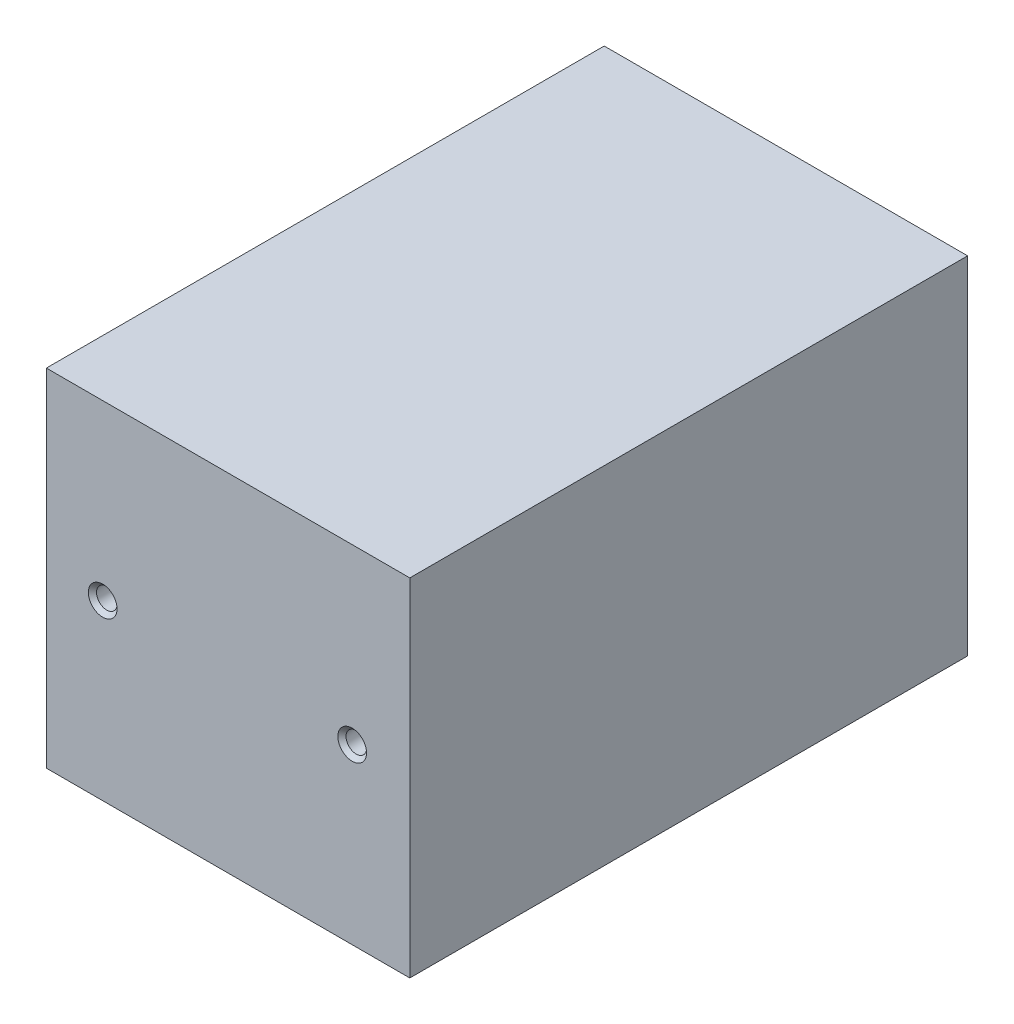
ISO-10303-21;
HEADER;
FILE_DESCRIPTION(('STEP AP214'),'2;1');
FILE_NAME('part.step','',(''),(''),'','','');
FILE_SCHEMA(('AUTOMOTIVE_DESIGN { 1 0 10303 214 1 1 1 1 }'));
ENDSEC;
DATA;
#1=APPLICATION_CONTEXT('core data for automotive mechanical design processes');
#2=APPLICATION_PROTOCOL_DEFINITION('international standard','automotive_design',2000,#1);
#3=PRODUCT_CONTEXT('',#1,'mechanical');
#4=PRODUCT('Part','Part','',(#3));
#5=PRODUCT_RELATED_PRODUCT_CATEGORY('part','',(#4));
#6=PRODUCT_DEFINITION_FORMATION('','',#4);
#7=PRODUCT_DEFINITION_CONTEXT('part definition',#1,'design');
#8=PRODUCT_DEFINITION('design','',#6,#7);
#9=PRODUCT_DEFINITION_SHAPE('','',#8);
#10=(LENGTH_UNIT() NAMED_UNIT(*) SI_UNIT(.MILLI.,.METRE.));
#11=(NAMED_UNIT(*) PLANE_ANGLE_UNIT() SI_UNIT($,.RADIAN.));
#12=(NAMED_UNIT(*) SI_UNIT($,.STERADIAN.) SOLID_ANGLE_UNIT());
#13=UNCERTAINTY_MEASURE_WITH_UNIT(LENGTH_MEASURE(1.E-05),#10,'distance_accuracy_value','');
#14=(GEOMETRIC_REPRESENTATION_CONTEXT(3) GLOBAL_UNCERTAINTY_ASSIGNED_CONTEXT((#13)) GLOBAL_UNIT_ASSIGNED_CONTEXT((#10,
#11,#12)) REPRESENTATION_CONTEXT('',''));
#15=CARTESIAN_POINT('',(0.,0.,0.));
#16=DIRECTION('',(0.,0.,1.));
#17=DIRECTION('',(1.,0.,0.));
#18=AXIS2_PLACEMENT_3D('',#15,#16,#17);
#19=CARTESIAN_POINT('',(0.,0.,70.7677977931643));
#20=DIRECTION('',(0.,0.,-1.));
#21=DIRECTION('',(-1.,0.,0.));
#22=AXIS2_PLACEMENT_3D('',#19,#20,#21);
#23=PLANE('',#22);
#24=DIRECTION('',(0.,-1.,0.));
#25=VECTOR('',#24,1.);
#26=CARTESIAN_POINT('',(-44.3132449822676,-42.25,70.7677977931643));
#27=LINE('',#26,#25);
#28=CARTESIAN_POINT('',(-44.3132449822676,42.25,70.7677977931643));
#29=VERTEX_POINT('',#28);
#30=CARTESIAN_POINT('',(-44.3132449822676,-42.25,70.7677977931643));
#31=VERTEX_POINT('',#30);
#32=EDGE_CURVE('E129',#29,#31,#27,.T.);
#33=ORIENTED_EDGE('',*,*,#32,.T.);
#34=DIRECTION('',(1.,0.,0.));
#35=VECTOR('',#34,1.);
#36=CARTESIAN_POINT('',(-44.3132449822676,-42.25,70.7677977931643));
#37=LINE('',#36,#35);
#38=CARTESIAN_POINT('',(44.3132449822676,-42.25,70.7677977931643));
#39=VERTEX_POINT('',#38);
#40=EDGE_CURVE('E134',#31,#39,#37,.T.);
#41=ORIENTED_EDGE('',*,*,#40,.T.);
#42=DIRECTION('',(0.,1.,0.));
#43=VECTOR('',#42,1.);
#44=CARTESIAN_POINT('',(44.3132449822676,-42.25,70.7677977931643));
#45=LINE('',#44,#43);
#46=CARTESIAN_POINT('',(44.3132449822676,42.25,70.7677977931643));
#47=VERTEX_POINT('',#46);
#48=EDGE_CURVE('E141',#39,#47,#45,.T.);
#49=ORIENTED_EDGE('',*,*,#48,.T.);
#50=DIRECTION('',(-1.,0.,0.));
#51=VECTOR('',#50,1.);
#52=CARTESIAN_POINT('',(-44.3132449822676,42.25,70.7677977931643));
#53=LINE('',#52,#51);
#54=EDGE_CURVE('E144',#47,#29,#53,.T.);
#55=ORIENTED_EDGE('',*,*,#54,.T.);
#56=EDGE_LOOP('',(#33,#41,#49,#55));
#57=FACE_BOUND('',#56,.T.);
#58=CARTESIAN_POINT('',(30.2659993151337,0.,70.7677977931643));
#59=DIRECTION('',(0.,0.,1.));
#60=DIRECTION('',(1.,0.,0.));
#61=AXIS2_PLACEMENT_3D('',#58,#59,#60);
#62=CIRCLE('',#61,3.5);
#63=CARTESIAN_POINT('',(33.7659993151337,0.,70.7677977931643));
#64=VERTEX_POINT('',#63);
#65=EDGE_CURVE('E399',#64,#64,#62,.T.);
#66=ORIENTED_EDGE('',*,*,#65,.F.);
#67=EDGE_LOOP('',(#66));
#68=FACE_BOUND('',#67,.T.);
#69=CARTESIAN_POINT('',(-30.5781129180046,0.,70.7677977931643));
#70=DIRECTION('',(0.,0.,1.));
#71=DIRECTION('',(1.,0.,0.));
#72=AXIS2_PLACEMENT_3D('',#69,#70,#71);
#73=CIRCLE('',#72,3.5);
#74=CARTESIAN_POINT('',(-27.0781129180046,0.,70.7677977931643));
#75=VERTEX_POINT('',#74);
#76=EDGE_CURVE('E388',#75,#75,#73,.T.);
#77=ORIENTED_EDGE('',*,*,#76,.F.);
#78=EDGE_LOOP('',(#77));
#79=FACE_BOUND('',#78,.T.);
#80=ADVANCED_FACE('F43',(#57,#68,#79),#23,.F.);
#81=CARTESIAN_POINT('',(43.3132449822676,42.25,65.2677977931643));
#82=DIRECTION('',(-1.,0.,0.));
#83=DIRECTION('',(0.,0.,1.));
#84=AXIS2_PLACEMENT_3D('',#81,#82,#83);
#85=PLANE('',#84);
#86=DIRECTION('',(0.,0.,-1.));
#87=VECTOR('',#86,1.);
#88=CARTESIAN_POINT('',(43.3132449822676,-41.25,0.));
#89=LINE('',#88,#87);
#90=CARTESIAN_POINT('',(43.3132449822676,-41.25,64.2677977931643));
#91=VERTEX_POINT('',#90);
#92=CARTESIAN_POINT('',(43.3132449822676,-41.25,-64.2677977931643));
#93=VERTEX_POINT('',#92);
#94=EDGE_CURVE('E47',#91,#93,#89,.T.);
#95=ORIENTED_EDGE('',*,*,#94,.F.);
#96=DIRECTION('',(0.,-1.,0.));
#97=VECTOR('',#96,1.);
#98=CARTESIAN_POINT('',(43.3132449822676,42.25,64.2677977931643));
#99=LINE('',#98,#97);
#100=CARTESIAN_POINT('',(43.3132449822676,41.25,64.2677977931643));
#101=VERTEX_POINT('',#100);
#102=EDGE_CURVE('E177',#101,#91,#99,.T.);
#103=ORIENTED_EDGE('',*,*,#102,.F.);
#104=DIRECTION('',(0.,0.,-1.));
#105=VECTOR('',#104,1.);
#106=CARTESIAN_POINT('',(43.3132449822676,41.25,0.));
#107=LINE('',#106,#105);
#108=CARTESIAN_POINT('',(43.3132449822676,41.25,-64.2677977931643));
#109=VERTEX_POINT('',#108);
#110=EDGE_CURVE('E164',#101,#109,#107,.T.);
#111=ORIENTED_EDGE('',*,*,#110,.T.);
#112=DIRECTION('',(0.,-1.,0.));
#113=VECTOR('',#112,1.);
#114=CARTESIAN_POINT('',(43.3132449822676,42.25,-64.2677977931643));
#115=LINE('',#114,#113);
#116=EDGE_CURVE('E175',#109,#93,#115,.T.);
#117=ORIENTED_EDGE('',*,*,#116,.T.);
#118=EDGE_LOOP('',(#95,#103,#111,#117));
#119=FACE_BOUND('',#118,.T.);
#120=ADVANCED_FACE('F184',(#119),#85,.T.);
#121=CARTESIAN_POINT('',(-44.3132449822676,42.25,-64.2677977931643));
#122=DIRECTION('',(0.,0.,1.));
#123=DIRECTION('',(1.,0.,0.));
#124=AXIS2_PLACEMENT_3D('',#121,#122,#123);
#125=PLANE('',#124);
#126=DIRECTION('',(-1.,0.,0.));
#127=VECTOR('',#126,1.);
#128=CARTESIAN_POINT('',(0.,-41.25,-64.2677977931643));
#129=LINE('',#128,#127);
#130=CARTESIAN_POINT('',(-43.3132449822676,-41.25,-64.2677977931643));
#131=VERTEX_POINT('',#130);
#132=EDGE_CURVE('E62',#93,#131,#129,.T.);
#133=ORIENTED_EDGE('',*,*,#132,.F.);
#134=ORIENTED_EDGE('',*,*,#116,.F.);
#135=DIRECTION('',(-1.,0.,0.));
#136=VECTOR('',#135,1.);
#137=CARTESIAN_POINT('',(0.,41.25,-64.2677977931643));
#138=LINE('',#137,#136);
#139=CARTESIAN_POINT('',(-43.3132449822676,41.25,-64.2677977931643));
#140=VERTEX_POINT('',#139);
#141=EDGE_CURVE('E85',#109,#140,#138,.T.);
#142=ORIENTED_EDGE('',*,*,#141,.T.);
#143=DIRECTION('',(0.,-1.,0.));
#144=VECTOR('',#143,1.);
#145=CARTESIAN_POINT('',(-43.3132449822676,42.25,-64.2677977931643));
#146=LINE('',#145,#144);
#147=EDGE_CURVE('E171',#140,#131,#146,.T.);
#148=ORIENTED_EDGE('',*,*,#147,.T.);
#149=EDGE_LOOP('',(#133,#134,#142,#148));
#150=FACE_BOUND('',#149,.T.);
#151=ADVANCED_FACE('F185',(#150),#125,.T.);
#152=CARTESIAN_POINT('',(-43.3132449822676,42.25,65.2677977931643));
#153=DIRECTION('',(1.,0.,0.));
#154=DIRECTION('',(0.,0.,-1.));
#155=AXIS2_PLACEMENT_3D('',#152,#153,#154);
#156=PLANE('',#155);
#157=DIRECTION('',(0.,0.,1.));
#158=VECTOR('',#157,1.);
#159=CARTESIAN_POINT('',(-43.3132449822676,-41.25,0.));
#160=LINE('',#159,#158);
#161=CARTESIAN_POINT('',(-43.3132449822676,-41.25,64.2677977931643));
#162=VERTEX_POINT('',#161);
#163=EDGE_CURVE('E173',#131,#162,#160,.T.);
#164=ORIENTED_EDGE('',*,*,#163,.F.);
#165=ORIENTED_EDGE('',*,*,#147,.F.);
#166=DIRECTION('',(0.,0.,1.));
#167=VECTOR('',#166,1.);
#168=CARTESIAN_POINT('',(-43.3132449822676,41.25,0.));
#169=LINE('',#168,#167);
#170=CARTESIAN_POINT('',(-43.3132449822676,41.25,64.2677977931643));
#171=VERTEX_POINT('',#170);
#172=EDGE_CURVE('E53',#140,#171,#169,.T.);
#173=ORIENTED_EDGE('',*,*,#172,.T.);
#174=DIRECTION('',(0.,-1.,0.));
#175=VECTOR('',#174,1.);
#176=CARTESIAN_POINT('',(-43.3132449822676,42.25,64.2677977931643));
#177=LINE('',#176,#175);
#178=EDGE_CURVE('E166',#171,#162,#177,.T.);
#179=ORIENTED_EDGE('',*,*,#178,.T.);
#180=EDGE_LOOP('',(#164,#165,#173,#179));
#181=FACE_BOUND('',#180,.T.);
#182=ADVANCED_FACE('F189',(#181),#156,.T.);
#183=CARTESIAN_POINT('',(-44.3132449822676,42.25,64.2677977931643));
#184=DIRECTION('',(0.,0.,-1.));
#185=DIRECTION('',(-1.,0.,0.));
#186=AXIS2_PLACEMENT_3D('',#183,#184,#185);
#187=PLANE('',#186);
#188=CARTESIAN_POINT('',(-30.5781129180046,0.,64.2677977931643));
#189=DIRECTION('',(0.,0.,-1.));
#190=DIRECTION('',(-1.,0.,0.));
#191=AXIS2_PLACEMENT_3D('',#188,#189,#190);
#192=CIRCLE('',#191,2.5);
#193=CARTESIAN_POINT('',(-33.0781129180046,0.,64.2677977931643));
#194=VERTEX_POINT('',#193);
#195=EDGE_CURVE('E394',#194,#194,#192,.T.);
#196=ORIENTED_EDGE('',*,*,#195,.F.);
#197=EDGE_LOOP('',(#196));
#198=FACE_BOUND('',#197,.T.);
#199=CARTESIAN_POINT('',(30.2659993151337,0.,64.2677977931643));
#200=DIRECTION('',(0.,0.,-1.));
#201=DIRECTION('',(-1.,0.,0.));
#202=AXIS2_PLACEMENT_3D('',#199,#200,#201);
#203=CIRCLE('',#202,2.5);
#204=CARTESIAN_POINT('',(27.7659993151337,0.,64.2677977931643));
#205=VERTEX_POINT('',#204);
#206=EDGE_CURVE('E145',#205,#205,#203,.T.);
#207=ORIENTED_EDGE('',*,*,#206,.F.);
#208=EDGE_LOOP('',(#207));
#209=FACE_BOUND('',#208,.T.);
#210=DIRECTION('',(1.,0.,0.));
#211=VECTOR('',#210,1.);
#212=CARTESIAN_POINT('',(0.,-41.25,64.2677977931643));
#213=LINE('',#212,#211);
#214=EDGE_CURVE('E169',#162,#91,#213,.T.);
#215=ORIENTED_EDGE('',*,*,#214,.F.);
#216=ORIENTED_EDGE('',*,*,#178,.F.);
#217=DIRECTION('',(1.,0.,0.));
#218=VECTOR('',#217,1.);
#219=CARTESIAN_POINT('',(0.,41.25,64.2677977931643));
#220=LINE('',#219,#218);
#221=EDGE_CURVE('E11',#171,#101,#220,.T.);
#222=ORIENTED_EDGE('',*,*,#221,.T.);
#223=ORIENTED_EDGE('',*,*,#102,.T.);
#224=EDGE_LOOP('',(#215,#216,#222,#223));
#225=FACE_BOUND('',#224,.T.);
#226=ADVANCED_FACE('F193',(#198,#209,#225),#187,.T.);
#227=CARTESIAN_POINT('',(0.,41.25,0.));
#228=DIRECTION('',(0.,-1.,0.));
#229=DIRECTION('',(0.,0.,-1.));
#230=AXIS2_PLACEMENT_3D('',#227,#228,#229);
#231=PLANE('',#230);
#232=ORIENTED_EDGE('',*,*,#110,.F.);
#233=ORIENTED_EDGE('',*,*,#221,.F.);
#234=ORIENTED_EDGE('',*,*,#172,.F.);
#235=ORIENTED_EDGE('',*,*,#141,.F.);
#236=EDGE_LOOP('',(#232,#233,#234,#235));
#237=FACE_BOUND('',#236,.T.);
#238=ADVANCED_FACE('F192',(#237),#231,.T.);
#239=CARTESIAN_POINT('',(0.,-41.25,0.));
#240=DIRECTION('',(0.,-1.,0.));
#241=DIRECTION('',(0.,0.,-1.));
#242=AXIS2_PLACEMENT_3D('',#239,#240,#241);
#243=PLANE('',#242);
#244=ORIENTED_EDGE('',*,*,#94,.T.);
#245=ORIENTED_EDGE('',*,*,#132,.T.);
#246=ORIENTED_EDGE('',*,*,#163,.T.);
#247=ORIENTED_EDGE('',*,*,#214,.T.);
#248=EDGE_LOOP('',(#244,#245,#246,#247));
#249=FACE_BOUND('',#248,.T.);
#250=ADVANCED_FACE('F45',(#249),#243,.F.);
#251=CARTESIAN_POINT('',(30.2659993151337,0.,70.7677977931643));
#252=DIRECTION('',(0.,0.,1.));
#253=DIRECTION('',(1.,0.,0.));
#254=AXIS2_PLACEMENT_3D('',#251,#252,#253);
#255=CYLINDRICAL_SURFACE('',#254,2.5);
#256=CARTESIAN_POINT('',(30.2659993151337,0.,69.7677977931643));
#257=DIRECTION('',(0.,0.,1.));
#258=DIRECTION('',(1.,0.,0.));
#259=AXIS2_PLACEMENT_3D('',#256,#257,#258);
#260=CIRCLE('',#259,2.5);
#261=CARTESIAN_POINT('',(32.7659993151337,0.,69.7677977931643));
#262=VERTEX_POINT('',#261);
#263=EDGE_CURVE('E148',#262,#262,#260,.T.);
#264=ORIENTED_EDGE('',*,*,#263,.T.);
#265=EDGE_LOOP('',(#264));
#266=FACE_BOUND('',#265,.T.);
#267=ORIENTED_EDGE('',*,*,#206,.T.);
#268=EDGE_LOOP('',(#267));
#269=FACE_BOUND('',#268,.T.);
#270=ADVANCED_FACE('F212',(#266,#269),#255,.F.);
#271=CARTESIAN_POINT('',(30.2659993151337,0.,70.7677977931643));
#272=DIRECTION('',(0.,0.,1.));
#273=DIRECTION('',(1.,0.,0.));
#274=AXIS2_PLACEMENT_3D('',#271,#272,#273);
#275=CONICAL_SURFACE('',#274,3.5,0.785398163397452);
#276=ORIENTED_EDGE('',*,*,#263,.F.);
#277=EDGE_LOOP('',(#276));
#278=FACE_BOUND('',#277,.T.);
#279=ORIENTED_EDGE('',*,*,#65,.T.);
#280=EDGE_LOOP('',(#279));
#281=FACE_BOUND('',#280,.T.);
#282=ADVANCED_FACE('F228',(#278,#281),#275,.F.);
#283=CARTESIAN_POINT('',(44.3132449822676,42.25,65.2677977931643));
#284=DIRECTION('',(-1.,0.,0.));
#285=DIRECTION('',(0.,0.,1.));
#286=AXIS2_PLACEMENT_3D('',#283,#284,#285);
#287=PLANE('',#286);
#288=DIRECTION('',(0.,0.,-1.));
#289=VECTOR('',#288,1.);
#290=CARTESIAN_POINT('',(44.3132449822676,-42.25,65.2677977931643));
#291=LINE('',#290,#289);
#292=CARTESIAN_POINT('',(44.3132449822676,-42.25,-65.2677977931643));
#293=VERTEX_POINT('',#292);
#294=EDGE_CURVE('E137',#39,#293,#291,.T.);
#295=ORIENTED_EDGE('',*,*,#294,.T.);
#296=DIRECTION('',(0.,-1.,0.));
#297=VECTOR('',#296,1.);
#298=CARTESIAN_POINT('',(44.3132449822676,42.25,-65.2677977931643));
#299=LINE('',#298,#297);
#300=CARTESIAN_POINT('',(44.3132449822676,42.25,-65.2677977931643));
#301=VERTEX_POINT('',#300);
#302=EDGE_CURVE('E160',#301,#293,#299,.T.);
#303=ORIENTED_EDGE('',*,*,#302,.F.);
#304=DIRECTION('',(0.,0.,-1.));
#305=VECTOR('',#304,1.);
#306=CARTESIAN_POINT('',(44.3132449822676,42.25,65.2677977931643));
#307=LINE('',#306,#305);
#308=EDGE_CURVE('E131',#47,#301,#307,.T.);
#309=ORIENTED_EDGE('',*,*,#308,.F.);
#310=ORIENTED_EDGE('',*,*,#48,.F.);
#311=EDGE_LOOP('',(#295,#303,#309,#310));
#312=FACE_BOUND('',#311,.T.);
#313=ADVANCED_FACE('F225',(#312),#287,.F.);
#314=CARTESIAN_POINT('',(-44.3132449822676,42.25,-65.2677977931643));
#315=DIRECTION('',(0.,0.,1.));
#316=DIRECTION('',(1.,0.,0.));
#317=AXIS2_PLACEMENT_3D('',#314,#315,#316);
#318=PLANE('',#317);
#319=DIRECTION('',(-1.,0.,0.));
#320=VECTOR('',#319,1.);
#321=CARTESIAN_POINT('',(-44.3132449822676,-42.25,-65.2677977931643));
#322=LINE('',#321,#320);
#323=CARTESIAN_POINT('',(-44.3132449822676,-42.25,-65.2677977931643));
#324=VERTEX_POINT('',#323);
#325=EDGE_CURVE('E108',#293,#324,#322,.T.);
#326=ORIENTED_EDGE('',*,*,#325,.T.);
#327=DIRECTION('',(0.,-1.,0.));
#328=VECTOR('',#327,1.);
#329=CARTESIAN_POINT('',(-44.3132449822676,42.25,-65.2677977931643));
#330=LINE('',#329,#328);
#331=CARTESIAN_POINT('',(-44.3132449822676,42.25,-65.2677977931643));
#332=VERTEX_POINT('',#331);
#333=EDGE_CURVE('E130',#332,#324,#330,.T.);
#334=ORIENTED_EDGE('',*,*,#333,.F.);
#335=DIRECTION('',(-1.,0.,0.));
#336=VECTOR('',#335,1.);
#337=CARTESIAN_POINT('',(-44.3132449822676,42.25,-65.2677977931643));
#338=LINE('',#337,#336);
#339=EDGE_CURVE('E97',#301,#332,#338,.T.);
#340=ORIENTED_EDGE('',*,*,#339,.F.);
#341=ORIENTED_EDGE('',*,*,#302,.T.);
#342=EDGE_LOOP('',(#326,#334,#340,#341));
#343=FACE_BOUND('',#342,.T.);
#344=ADVANCED_FACE('F222',(#343),#318,.F.);
#345=CARTESIAN_POINT('',(-44.3132449822676,42.25,65.2677977931643));
#346=DIRECTION('',(1.,0.,0.));
#347=DIRECTION('',(0.,0.,-1.));
#348=AXIS2_PLACEMENT_3D('',#345,#346,#347);
#349=PLANE('',#348);
#350=DIRECTION('',(0.,0.,1.));
#351=VECTOR('',#350,1.);
#352=CARTESIAN_POINT('',(-44.3132449822676,-42.25,65.2677977931643));
#353=LINE('',#352,#351);
#354=EDGE_CURVE('E125',#324,#31,#353,.T.);
#355=ORIENTED_EDGE('',*,*,#354,.T.);
#356=ORIENTED_EDGE('',*,*,#32,.F.);
#357=DIRECTION('',(0.,0.,1.));
#358=VECTOR('',#357,1.);
#359=CARTESIAN_POINT('',(-44.3132449822676,42.25,65.2677977931643));
#360=LINE('',#359,#358);
#361=EDGE_CURVE('E113',#332,#29,#360,.T.);
#362=ORIENTED_EDGE('',*,*,#361,.F.);
#363=ORIENTED_EDGE('',*,*,#333,.T.);
#364=EDGE_LOOP('',(#355,#356,#362,#363));
#365=FACE_BOUND('',#364,.T.);
#366=ADVANCED_FACE('F127',(#365),#349,.F.);
#367=CARTESIAN_POINT('',(0.,42.25,0.));
#368=DIRECTION('',(0.,-1.,0.));
#369=DIRECTION('',(0.,0.,-1.));
#370=AXIS2_PLACEMENT_3D('',#367,#368,#369);
#371=PLANE('',#370);
#372=ORIENTED_EDGE('',*,*,#308,.T.);
#373=ORIENTED_EDGE('',*,*,#339,.T.);
#374=ORIENTED_EDGE('',*,*,#361,.T.);
#375=ORIENTED_EDGE('',*,*,#54,.F.);
#376=EDGE_LOOP('',(#372,#373,#374,#375));
#377=FACE_BOUND('',#376,.T.);
#378=ADVANCED_FACE('F214',(#377),#371,.F.);
#379=CARTESIAN_POINT('',(0.,-42.25,0.));
#380=DIRECTION('',(0.,-1.,0.));
#381=DIRECTION('',(0.,0.,-1.));
#382=AXIS2_PLACEMENT_3D('',#379,#380,#381);
#383=PLANE('',#382);
#384=ORIENTED_EDGE('',*,*,#294,.F.);
#385=ORIENTED_EDGE('',*,*,#40,.F.);
#386=ORIENTED_EDGE('',*,*,#354,.F.);
#387=ORIENTED_EDGE('',*,*,#325,.F.);
#388=EDGE_LOOP('',(#384,#385,#386,#387));
#389=FACE_BOUND('',#388,.T.);
#390=ADVANCED_FACE('F135',(#389),#383,.T.);
#391=CARTESIAN_POINT('',(-30.5781129180046,0.,70.7677977931643));
#392=DIRECTION('',(0.,0.,1.));
#393=DIRECTION('',(1.,0.,0.));
#394=AXIS2_PLACEMENT_3D('',#391,#392,#393);
#395=CYLINDRICAL_SURFACE('',#394,2.5);
#396=CARTESIAN_POINT('',(-30.5781129180046,0.,69.7677977931643));
#397=DIRECTION('',(0.,0.,1.));
#398=DIRECTION('',(1.,0.,0.));
#399=AXIS2_PLACEMENT_3D('',#396,#397,#398);
#400=CIRCLE('',#399,2.5);
#401=CARTESIAN_POINT('',(-28.0781129180046,0.,69.7677977931643));
#402=VERTEX_POINT('',#401);
#403=EDGE_CURVE('E385',#402,#402,#400,.T.);
#404=ORIENTED_EDGE('',*,*,#403,.T.);
#405=EDGE_LOOP('',(#404));
#406=FACE_BOUND('',#405,.T.);
#407=ORIENTED_EDGE('',*,*,#195,.T.);
#408=EDGE_LOOP('',(#407));
#409=FACE_BOUND('',#408,.T.);
#410=ADVANCED_FACE('F219',(#406,#409),#395,.F.);
#411=CARTESIAN_POINT('',(-30.5781129180046,0.,70.7677977931643));
#412=DIRECTION('',(0.,0.,1.));
#413=DIRECTION('',(1.,0.,0.));
#414=AXIS2_PLACEMENT_3D('',#411,#412,#413);
#415=CONICAL_SURFACE('',#414,3.5,0.785398163397448);
#416=ORIENTED_EDGE('',*,*,#403,.F.);
#417=EDGE_LOOP('',(#416));
#418=FACE_BOUND('',#417,.T.);
#419=ORIENTED_EDGE('',*,*,#76,.T.);
#420=EDGE_LOOP('',(#419));
#421=FACE_BOUND('',#420,.T.);
#422=ADVANCED_FACE('F323',(#418,#421),#415,.F.);
#423=CLOSED_SHELL('',(#80,#120,#151,#182,#226,#238,#250,#270,#282,#313,#344,#366,#378,#390,#410,#422));
#424=MANIFOLD_SOLID_BREP('B2',#423);
#425=ADVANCED_BREP_SHAPE_REPRESENTATION('',(#18,#424),#14);
#426=SHAPE_DEFINITION_REPRESENTATION(#9,#425);
ENDSEC;
END-ISO-10303-21;
